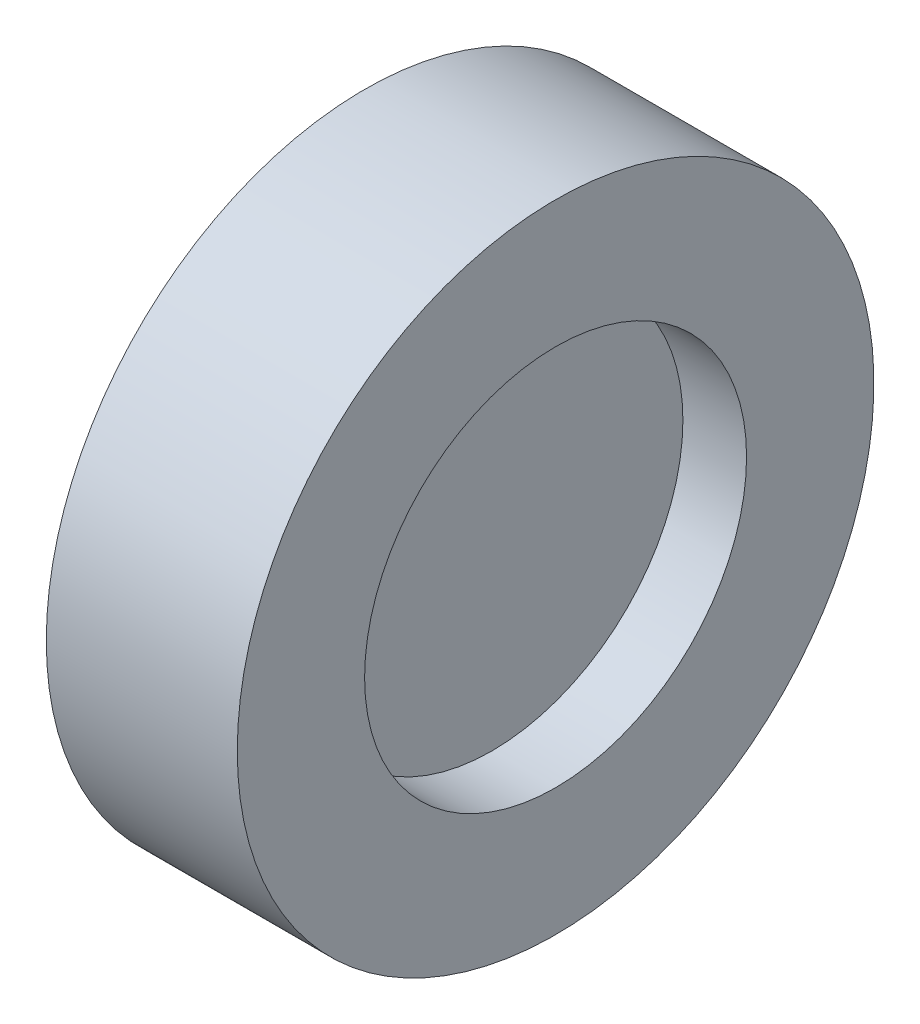
ISO-10303-21;
HEADER;
FILE_DESCRIPTION(('STEP AP214'),'2;1');
FILE_NAME('part.step','',(''),(''),'','','');
FILE_SCHEMA(('AUTOMOTIVE_DESIGN { 1 0 10303 214 1 1 1 1 }'));
ENDSEC;
DATA;
#1=APPLICATION_CONTEXT('core data for automotive mechanical design processes');
#2=APPLICATION_PROTOCOL_DEFINITION('international standard','automotive_design',2000,#1);
#3=PRODUCT_CONTEXT('',#1,'mechanical');
#4=PRODUCT('Part','Part','',(#3));
#5=PRODUCT_RELATED_PRODUCT_CATEGORY('part','',(#4));
#6=PRODUCT_DEFINITION_FORMATION('','',#4);
#7=PRODUCT_DEFINITION_CONTEXT('part definition',#1,'design');
#8=PRODUCT_DEFINITION('design','',#6,#7);
#9=PRODUCT_DEFINITION_SHAPE('','',#8);
#10=(LENGTH_UNIT() NAMED_UNIT(*) SI_UNIT(.MILLI.,.METRE.));
#11=(NAMED_UNIT(*) PLANE_ANGLE_UNIT() SI_UNIT($,.RADIAN.));
#12=(NAMED_UNIT(*) SI_UNIT($,.STERADIAN.) SOLID_ANGLE_UNIT());
#13=UNCERTAINTY_MEASURE_WITH_UNIT(LENGTH_MEASURE(1.E-05),#10,'distance_accuracy_value','');
#14=(GEOMETRIC_REPRESENTATION_CONTEXT(3) GLOBAL_UNCERTAINTY_ASSIGNED_CONTEXT((#13)) GLOBAL_UNIT_ASSIGNED_CONTEXT((#10,
#11,#12)) REPRESENTATION_CONTEXT('',''));
#15=CARTESIAN_POINT('',(0.,0.,0.));
#16=DIRECTION('',(0.,0.,1.));
#17=DIRECTION('',(1.,0.,0.));
#18=AXIS2_PLACEMENT_3D('',#15,#16,#17);
#19=CARTESIAN_POINT('',(0.5,3.,0.));
#20=DIRECTION('',(-1.,0.,0.));
#21=DIRECTION('',(0.,0.,1.));
#22=AXIS2_PLACEMENT_3D('',#19,#20,#21);
#23=PLANE('',#22);
#24=CARTESIAN_POINT('',(0.5,0.,0.));
#25=DIRECTION('',(-1.,0.,0.));
#26=DIRECTION('',(0.,0.,1.));
#27=AXIS2_PLACEMENT_3D('',#24,#25,#26);
#28=CIRCLE('',#27,3.);
#29=CARTESIAN_POINT('',(0.5,0.,3.));
#30=VERTEX_POINT('',#29);
#31=EDGE_CURVE('E10',#30,#30,#28,.T.);
#32=ORIENTED_EDGE('',*,*,#31,.F.);
#33=EDGE_LOOP('',(#32));
#34=FACE_BOUND('',#33,.T.);
#35=ADVANCED_FACE('F33',(#34),#23,.F.);
#36=CARTESIAN_POINT('',(-1.61421241885762,0.,0.));
#37=DIRECTION('',(-1.,0.,0.));
#38=DIRECTION('',(0.,0.,1.));
#39=AXIS2_PLACEMENT_3D('',#36,#37,#38);
#40=CYLINDRICAL_SURFACE('',#39,3.);
#41=CARTESIAN_POINT('',(1.5,0.,0.));
#42=DIRECTION('',(-1.,0.,0.));
#43=DIRECTION('',(0.,0.,1.));
#44=AXIS2_PLACEMENT_3D('',#41,#42,#43);
#45=CIRCLE('',#44,3.);
#46=CARTESIAN_POINT('',(1.5,0.,3.));
#47=VERTEX_POINT('',#46);
#48=EDGE_CURVE('E52',#47,#47,#45,.T.);
#49=ORIENTED_EDGE('',*,*,#48,.F.);
#50=EDGE_LOOP('',(#49));
#51=FACE_BOUND('',#50,.T.);
#52=ORIENTED_EDGE('',*,*,#31,.T.);
#53=EDGE_LOOP('',(#52));
#54=FACE_BOUND('',#53,.T.);
#55=ADVANCED_FACE('F80',(#51,#54),#40,.F.);
#56=CARTESIAN_POINT('',(-1.5,0.,0.));
#57=DIRECTION('',(-1.,0.,0.));
#58=DIRECTION('',(0.,0.,1.));
#59=AXIS2_PLACEMENT_3D('',#56,#57,#58);
#60=CIRCLE('',#59,3.);
#61=CARTESIAN_POINT('',(-1.5,0.,3.));
#62=VERTEX_POINT('',#61);
#63=EDGE_CURVE('E55',#62,#62,#60,.T.);
#64=ORIENTED_EDGE('',*,*,#63,.T.);
#65=EDGE_LOOP('',(#64));
#66=FACE_BOUND('',#65,.T.);
#67=CARTESIAN_POINT('',(-0.5,0.,0.));
#68=DIRECTION('',(1.,0.,0.));
#69=DIRECTION('',(0.,0.,-1.));
#70=AXIS2_PLACEMENT_3D('',#67,#68,#69);
#71=CIRCLE('',#70,3.);
#72=CARTESIAN_POINT('',(-0.5,0.,-3.));
#73=VERTEX_POINT('',#72);
#74=EDGE_CURVE('E39',#73,#73,#71,.T.);
#75=ORIENTED_EDGE('',*,*,#74,.T.);
#76=EDGE_LOOP('',(#75));
#77=FACE_BOUND('',#76,.T.);
#78=ADVANCED_FACE('F59',(#66,#77),#40,.F.);
#79=CARTESIAN_POINT('',(-1.5,3.,0.));
#80=DIRECTION('',(1.,0.,0.));
#81=DIRECTION('',(0.,0.,-1.));
#82=AXIS2_PLACEMENT_3D('',#79,#80,#81);
#83=PLANE('',#82);
#84=ORIENTED_EDGE('',*,*,#63,.F.);
#85=EDGE_LOOP('',(#84));
#86=FACE_BOUND('',#85,.T.);
#87=CARTESIAN_POINT('',(-1.5,0.,0.));
#88=DIRECTION('',(-1.,0.,0.));
#89=DIRECTION('',(0.,0.,1.));
#90=AXIS2_PLACEMENT_3D('',#87,#88,#89);
#91=CIRCLE('',#90,5.);
#92=CARTESIAN_POINT('',(-1.5,0.,5.));
#93=VERTEX_POINT('',#92);
#94=EDGE_CURVE('E43',#93,#93,#91,.T.);
#95=ORIENTED_EDGE('',*,*,#94,.T.);
#96=EDGE_LOOP('',(#95));
#97=FACE_BOUND('',#96,.T.);
#98=ADVANCED_FACE('F61',(#86,#97),#83,.F.);
#99=CARTESIAN_POINT('',(-1.61421241885762,0.,0.));
#100=DIRECTION('',(-1.,0.,0.));
#101=DIRECTION('',(0.,0.,1.));
#102=AXIS2_PLACEMENT_3D('',#99,#100,#101);
#103=CYLINDRICAL_SURFACE('',#102,5.);
#104=ORIENTED_EDGE('',*,*,#94,.F.);
#105=EDGE_LOOP('',(#104));
#106=FACE_BOUND('',#105,.T.);
#107=CARTESIAN_POINT('',(1.5,0.,0.));
#108=DIRECTION('',(-1.,0.,0.));
#109=DIRECTION('',(0.,0.,1.));
#110=AXIS2_PLACEMENT_3D('',#107,#108,#109);
#111=CIRCLE('',#110,5.);
#112=CARTESIAN_POINT('',(1.5,0.,5.));
#113=VERTEX_POINT('',#112);
#114=EDGE_CURVE('E47',#113,#113,#111,.T.);
#115=ORIENTED_EDGE('',*,*,#114,.T.);
#116=EDGE_LOOP('',(#115));
#117=FACE_BOUND('',#116,.T.);
#118=ADVANCED_FACE('F64',(#106,#117),#103,.T.);
#119=CARTESIAN_POINT('',(1.5,5.,0.));
#120=DIRECTION('',(-1.,0.,0.));
#121=DIRECTION('',(0.,0.,1.));
#122=AXIS2_PLACEMENT_3D('',#119,#120,#121);
#123=PLANE('',#122);
#124=ORIENTED_EDGE('',*,*,#114,.F.);
#125=EDGE_LOOP('',(#124));
#126=FACE_BOUND('',#125,.T.);
#127=ORIENTED_EDGE('',*,*,#48,.T.);
#128=EDGE_LOOP('',(#127));
#129=FACE_BOUND('',#128,.T.);
#130=ADVANCED_FACE('F70',(#126,#129),#123,.F.);
#131=CARTESIAN_POINT('',(-0.5,3.,0.));
#132=DIRECTION('',(1.,0.,0.));
#133=DIRECTION('',(0.,0.,-1.));
#134=AXIS2_PLACEMENT_3D('',#131,#132,#133);
#135=PLANE('',#134);
#136=ORIENTED_EDGE('',*,*,#74,.F.);
#137=EDGE_LOOP('',(#136));
#138=FACE_BOUND('',#137,.T.);
#139=ADVANCED_FACE('F76',(#138),#135,.F.);
#140=CLOSED_SHELL('',(#35,#55,#78,#98,#118,#130,#139));
#141=MANIFOLD_SOLID_BREP('B2',#140);
#142=ADVANCED_BREP_SHAPE_REPRESENTATION('',(#18,#141),#14);
#143=SHAPE_DEFINITION_REPRESENTATION(#9,#142);
ENDSEC;
END-ISO-10303-21;
